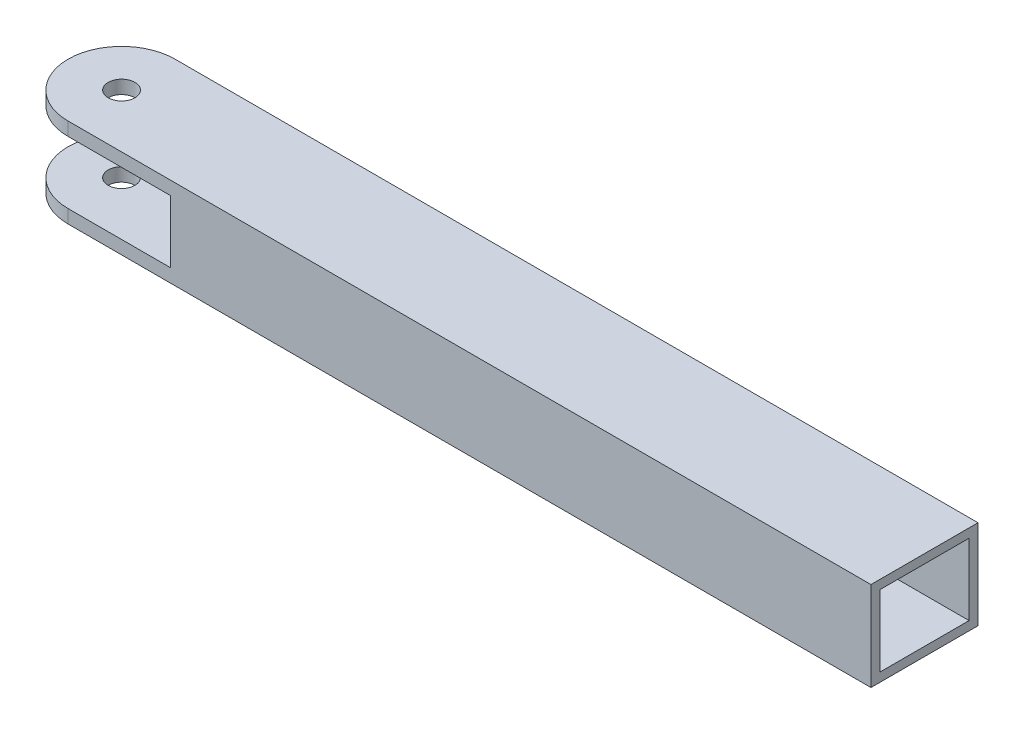
ISO-10303-21;
HEADER;
FILE_DESCRIPTION(('STEP AP214'),'2;1');
FILE_NAME('part.step','',(''),(''),'','','');
FILE_SCHEMA(('AUTOMOTIVE_DESIGN { 1 0 10303 214 1 1 1 1 }'));
ENDSEC;
DATA;
#1=APPLICATION_CONTEXT('core data for automotive mechanical design processes');
#2=APPLICATION_PROTOCOL_DEFINITION('international standard','automotive_design',2000,#1);
#3=PRODUCT_CONTEXT('',#1,'mechanical');
#4=PRODUCT('Part','Part','',(#3));
#5=PRODUCT_RELATED_PRODUCT_CATEGORY('part','',(#4));
#6=PRODUCT_DEFINITION_FORMATION('','',#4);
#7=PRODUCT_DEFINITION_CONTEXT('part definition',#1,'design');
#8=PRODUCT_DEFINITION('design','',#6,#7);
#9=PRODUCT_DEFINITION_SHAPE('','',#8);
#10=(LENGTH_UNIT() NAMED_UNIT(*) SI_UNIT(.MILLI.,.METRE.));
#11=(NAMED_UNIT(*) PLANE_ANGLE_UNIT() SI_UNIT($,.RADIAN.));
#12=(NAMED_UNIT(*) SI_UNIT($,.STERADIAN.) SOLID_ANGLE_UNIT());
#13=UNCERTAINTY_MEASURE_WITH_UNIT(LENGTH_MEASURE(1.E-05),#10,'distance_accuracy_value','');
#14=(GEOMETRIC_REPRESENTATION_CONTEXT(3) GLOBAL_UNCERTAINTY_ASSIGNED_CONTEXT((#13)) GLOBAL_UNIT_ASSIGNED_CONTEXT((#10,
#11,#12)) REPRESENTATION_CONTEXT('',''));
#15=CARTESIAN_POINT('',(0.,0.,0.));
#16=DIRECTION('',(0.,0.,1.));
#17=DIRECTION('',(1.,0.,0.));
#18=AXIS2_PLACEMENT_3D('',#15,#16,#17);
#19=CARTESIAN_POINT('',(0.,10.,0.));
#20=DIRECTION('',(0.,-1.,0.));
#21=DIRECTION('',(0.,0.,-1.));
#22=AXIS2_PLACEMENT_3D('',#19,#20,#21);
#23=CYLINDRICAL_SURFACE('',#22,6.);
#24=DIRECTION('',(0.,-1.,0.));
#25=VECTOR('',#24,1.);
#26=CARTESIAN_POINT('',(0.,10.,6.));
#27=LINE('',#26,#25);
#28=CARTESIAN_POINT('',(0.,1.5,6.));
#29=VERTEX_POINT('',#28);
#30=CARTESIAN_POINT('',(0.,0.,6.));
#31=VERTEX_POINT('',#30);
#32=EDGE_CURVE('E58',#29,#31,#27,.T.);
#33=ORIENTED_EDGE('',*,*,#32,.F.);
#34=CARTESIAN_POINT('',(0.,1.5,0.));
#35=DIRECTION('',(0.,-1.,0.));
#36=DIRECTION('',(0.,0.,-1.));
#37=AXIS2_PLACEMENT_3D('',#34,#35,#36);
#38=CIRCLE('',#37,6.);
#39=CARTESIAN_POINT('',(0.,1.5,-6.));
#40=VERTEX_POINT('',#39);
#41=EDGE_CURVE('E224',#29,#40,#38,.T.);
#42=ORIENTED_EDGE('',*,*,#41,.T.);
#43=DIRECTION('',(0.,-1.,0.));
#44=VECTOR('',#43,1.);
#45=CARTESIAN_POINT('',(0.,10.,-6.));
#46=LINE('',#45,#44);
#47=CARTESIAN_POINT('',(0.,0.,-6.));
#48=VERTEX_POINT('',#47);
#49=EDGE_CURVE('E250',#40,#48,#46,.T.);
#50=ORIENTED_EDGE('',*,*,#49,.T.);
#51=CARTESIAN_POINT('',(0.,0.,0.));
#52=DIRECTION('',(0.,1.,0.));
#53=DIRECTION('',(0.,0.,1.));
#54=AXIS2_PLACEMENT_3D('',#51,#52,#53);
#55=CIRCLE('',#54,6.);
#56=EDGE_CURVE('E233',#48,#31,#55,.T.);
#57=ORIENTED_EDGE('',*,*,#56,.T.);
#58=EDGE_LOOP('',(#33,#42,#50,#57));
#59=FACE_BOUND('',#58,.T.);
#60=ADVANCED_FACE('F48',(#59),#23,.T.);
#61=CARTESIAN_POINT('',(0.,10.,0.));
#62=DIRECTION('',(0.,-1.,0.));
#63=DIRECTION('',(0.,0.,-1.));
#64=AXIS2_PLACEMENT_3D('',#61,#62,#63);
#65=CYLINDRICAL_SURFACE('',#64,1.5);
#66=CARTESIAN_POINT('',(0.,1.5,0.));
#67=DIRECTION('',(0.,-1.,0.));
#68=DIRECTION('',(0.,0.,-1.));
#69=AXIS2_PLACEMENT_3D('',#66,#67,#68);
#70=CIRCLE('',#69,1.5);
#71=CARTESIAN_POINT('',(0.,1.5,-1.5));
#72=VERTEX_POINT('',#71);
#73=EDGE_CURVE('E52',#72,#72,#70,.T.);
#74=ORIENTED_EDGE('',*,*,#73,.F.);
#75=EDGE_LOOP('',(#74));
#76=FACE_BOUND('',#75,.T.);
#77=CARTESIAN_POINT('',(0.,0.,0.));
#78=DIRECTION('',(0.,1.,0.));
#79=DIRECTION('',(0.,0.,1.));
#80=AXIS2_PLACEMENT_3D('',#77,#78,#79);
#81=CIRCLE('',#80,1.5);
#82=CARTESIAN_POINT('',(0.,0.,1.5));
#83=VERTEX_POINT('',#82);
#84=EDGE_CURVE('E228',#83,#83,#81,.T.);
#85=ORIENTED_EDGE('',*,*,#84,.F.);
#86=EDGE_LOOP('',(#85));
#87=FACE_BOUND('',#86,.T.);
#88=ADVANCED_FACE('F288',(#76,#87),#65,.F.);
#89=CARTESIAN_POINT('',(0.,10.,0.));
#90=DIRECTION('',(0.,1.,0.));
#91=DIRECTION('',(0.,0.,1.));
#92=AXIS2_PLACEMENT_3D('',#89,#90,#91);
#93=PLANE('',#92);
#94=CARTESIAN_POINT('',(0.,10.,0.));
#95=DIRECTION('',(0.,1.,0.));
#96=DIRECTION('',(0.,0.,1.));
#97=AXIS2_PLACEMENT_3D('',#94,#95,#96);
#98=CIRCLE('',#97,6.);
#99=CARTESIAN_POINT('',(0.,10.,-6.));
#100=VERTEX_POINT('',#99);
#101=CARTESIAN_POINT('',(0.,10.,6.));
#102=VERTEX_POINT('',#101);
#103=EDGE_CURVE('E237',#100,#102,#98,.T.);
#104=ORIENTED_EDGE('',*,*,#103,.T.);
#105=DIRECTION('',(1.,0.,0.));
#106=VECTOR('',#105,1.);
#107=CARTESIAN_POINT('',(0.,10.,6.));
#108=LINE('',#107,#106);
#109=CARTESIAN_POINT('',(90.,10.,6.));
#110=VERTEX_POINT('',#109);
#111=EDGE_CURVE('E241',#102,#110,#108,.T.);
#112=ORIENTED_EDGE('',*,*,#111,.T.);
#113=DIRECTION('',(0.,0.,-1.));
#114=VECTOR('',#113,1.);
#115=CARTESIAN_POINT('',(90.,10.,-6.));
#116=LINE('',#115,#114);
#117=CARTESIAN_POINT('',(90.,10.,-6.));
#118=VERTEX_POINT('',#117);
#119=EDGE_CURVE('E244',#110,#118,#116,.T.);
#120=ORIENTED_EDGE('',*,*,#119,.T.);
#121=DIRECTION('',(-1.,0.,0.));
#122=VECTOR('',#121,1.);
#123=CARTESIAN_POINT('',(0.,10.,-6.));
#124=LINE('',#123,#122);
#125=EDGE_CURVE('E247',#118,#100,#124,.T.);
#126=ORIENTED_EDGE('',*,*,#125,.T.);
#127=EDGE_LOOP('',(#104,#112,#120,#126));
#128=FACE_BOUND('',#127,.T.);
#129=CARTESIAN_POINT('',(0.,10.,0.));
#130=DIRECTION('',(0.,1.,0.));
#131=DIRECTION('',(0.,0.,1.));
#132=AXIS2_PLACEMENT_3D('',#129,#130,#131);
#133=CIRCLE('',#132,1.5);
#134=CARTESIAN_POINT('',(0.,10.,1.5));
#135=VERTEX_POINT('',#134);
#136=EDGE_CURVE('E229',#135,#135,#133,.T.);
#137=ORIENTED_EDGE('',*,*,#136,.F.);
#138=EDGE_LOOP('',(#137));
#139=FACE_BOUND('',#138,.T.);
#140=ADVANCED_FACE('F291',(#128,#139),#93,.T.);
#141=CARTESIAN_POINT('',(0.,0.,0.));
#142=DIRECTION('',(0.,1.,0.));
#143=DIRECTION('',(0.,0.,1.));
#144=AXIS2_PLACEMENT_3D('',#141,#142,#143);
#145=PLANE('',#144);
#146=ORIENTED_EDGE('',*,*,#56,.F.);
#147=DIRECTION('',(-1.,0.,0.));
#148=VECTOR('',#147,1.);
#149=CARTESIAN_POINT('',(0.,0.,-6.));
#150=LINE('',#149,#148);
#151=CARTESIAN_POINT('',(90.,0.,-6.));
#152=VERTEX_POINT('',#151);
#153=EDGE_CURVE('E242',#152,#48,#150,.T.);
#154=ORIENTED_EDGE('',*,*,#153,.F.);
#155=DIRECTION('',(0.,0.,-1.));
#156=VECTOR('',#155,1.);
#157=CARTESIAN_POINT('',(90.,0.,-6.));
#158=LINE('',#157,#156);
#159=CARTESIAN_POINT('',(90.,0.,6.));
#160=VERTEX_POINT('',#159);
#161=EDGE_CURVE('E257',#160,#152,#158,.T.);
#162=ORIENTED_EDGE('',*,*,#161,.F.);
#163=DIRECTION('',(1.,0.,0.));
#164=VECTOR('',#163,1.);
#165=CARTESIAN_POINT('',(0.,0.,6.));
#166=LINE('',#165,#164);
#167=EDGE_CURVE('E254',#31,#160,#166,.T.);
#168=ORIENTED_EDGE('',*,*,#167,.F.);
#169=EDGE_LOOP('',(#146,#154,#162,#168));
#170=FACE_BOUND('',#169,.T.);
#171=ORIENTED_EDGE('',*,*,#84,.T.);
#172=EDGE_LOOP('',(#171));
#173=FACE_BOUND('',#172,.T.);
#174=ADVANCED_FACE('F293',(#170,#173),#145,.F.);
#175=CARTESIAN_POINT('',(0.,8.5,-6.));
#176=VERTEX_POINT('',#175);
#177=EDGE_CURVE('E263',#100,#176,#46,.T.);
#178=ORIENTED_EDGE('',*,*,#177,.T.);
#179=CARTESIAN_POINT('',(0.,8.5,0.));
#180=DIRECTION('',(0.,1.,0.));
#181=DIRECTION('',(0.,0.,1.));
#182=AXIS2_PLACEMENT_3D('',#179,#180,#181);
#183=CIRCLE('',#182,6.);
#184=CARTESIAN_POINT('',(0.,8.5,6.));
#185=VERTEX_POINT('',#184);
#186=EDGE_CURVE('E74',#176,#185,#183,.T.);
#187=ORIENTED_EDGE('',*,*,#186,.T.);
#188=EDGE_CURVE('E11',#102,#185,#27,.T.);
#189=ORIENTED_EDGE('',*,*,#188,.F.);
#190=ORIENTED_EDGE('',*,*,#103,.F.);
#191=EDGE_LOOP('',(#178,#187,#189,#190));
#192=FACE_BOUND('',#191,.T.);
#193=ADVANCED_FACE('F50',(#192),#23,.T.);
#194=CARTESIAN_POINT('',(0.,10.,6.));
#195=DIRECTION('',(0.,0.,-1.));
#196=DIRECTION('',(-1.,0.,0.));
#197=AXIS2_PLACEMENT_3D('',#194,#195,#196);
#198=PLANE('',#197);
#199=DIRECTION('',(0.,-1.,0.));
#200=VECTOR('',#199,1.);
#201=CARTESIAN_POINT('',(11.5,8.5,6.));
#202=LINE('',#201,#200);
#203=CARTESIAN_POINT('',(11.5,8.5,6.));
#204=VERTEX_POINT('',#203);
#205=CARTESIAN_POINT('',(11.5,1.5,6.));
#206=VERTEX_POINT('',#205);
#207=EDGE_CURVE('E198',#204,#206,#202,.T.);
#208=ORIENTED_EDGE('',*,*,#207,.T.);
#209=DIRECTION('',(-1.,0.,0.));
#210=VECTOR('',#209,1.);
#211=CARTESIAN_POINT('',(11.5,1.5,6.));
#212=LINE('',#211,#210);
#213=EDGE_CURVE('E203',#206,#29,#212,.T.);
#214=ORIENTED_EDGE('',*,*,#213,.T.);
#215=ORIENTED_EDGE('',*,*,#32,.T.);
#216=ORIENTED_EDGE('',*,*,#167,.T.);
#217=DIRECTION('',(0.,-1.,0.));
#218=VECTOR('',#217,1.);
#219=CARTESIAN_POINT('',(90.,10.,6.));
#220=LINE('',#219,#218);
#221=EDGE_CURVE('E271',#110,#160,#220,.T.);
#222=ORIENTED_EDGE('',*,*,#221,.F.);
#223=ORIENTED_EDGE('',*,*,#111,.F.);
#224=ORIENTED_EDGE('',*,*,#188,.T.);
#225=DIRECTION('',(1.,0.,0.));
#226=VECTOR('',#225,1.);
#227=CARTESIAN_POINT('',(11.5,8.5,6.));
#228=LINE('',#227,#226);
#229=EDGE_CURVE('E194',#185,#204,#228,.T.);
#230=ORIENTED_EDGE('',*,*,#229,.T.);
#231=EDGE_LOOP('',(#208,#214,#215,#216,#222,#223,#224,#230));
#232=FACE_BOUND('',#231,.T.);
#233=ADVANCED_FACE('F309',(#232),#198,.F.);
#234=CARTESIAN_POINT('',(90.,10.,-6.));
#235=DIRECTION('',(-1.,0.,0.));
#236=DIRECTION('',(0.,0.,1.));
#237=AXIS2_PLACEMENT_3D('',#234,#235,#236);
#238=PLANE('',#237);
#239=DIRECTION('',(0.,0.,1.));
#240=VECTOR('',#239,1.);
#241=CARTESIAN_POINT('',(90.,9.,-5.));
#242=LINE('',#241,#240);
#243=CARTESIAN_POINT('',(90.,9.,-5.));
#244=VERTEX_POINT('',#243);
#245=CARTESIAN_POINT('',(90.,9.,5.));
#246=VERTEX_POINT('',#245);
#247=EDGE_CURVE('E179',#244,#246,#242,.T.);
#248=ORIENTED_EDGE('',*,*,#247,.F.);
#249=DIRECTION('',(0.,1.,0.));
#250=VECTOR('',#249,1.);
#251=CARTESIAN_POINT('',(90.,1.,-5.));
#252=LINE('',#251,#250);
#253=CARTESIAN_POINT('',(90.,1.,-5.));
#254=VERTEX_POINT('',#253);
#255=EDGE_CURVE('E66',#254,#244,#252,.T.);
#256=ORIENTED_EDGE('',*,*,#255,.F.);
#257=DIRECTION('',(0.,0.,-1.));
#258=VECTOR('',#257,1.);
#259=CARTESIAN_POINT('',(90.,1.,5.));
#260=LINE('',#259,#258);
#261=CARTESIAN_POINT('',(90.,1.,5.));
#262=VERTEX_POINT('',#261);
#263=EDGE_CURVE('E163',#262,#254,#260,.T.);
#264=ORIENTED_EDGE('',*,*,#263,.F.);
#265=DIRECTION('',(0.,-1.,0.));
#266=VECTOR('',#265,1.);
#267=CARTESIAN_POINT('',(90.,9.,5.));
#268=LINE('',#267,#266);
#269=EDGE_CURVE('E170',#246,#262,#268,.T.);
#270=ORIENTED_EDGE('',*,*,#269,.F.);
#271=EDGE_LOOP('',(#248,#256,#264,#270));
#272=FACE_BOUND('',#271,.T.);
#273=ORIENTED_EDGE('',*,*,#161,.T.);
#274=DIRECTION('',(0.,-1.,0.));
#275=VECTOR('',#274,1.);
#276=CARTESIAN_POINT('',(90.,10.,-6.));
#277=LINE('',#276,#275);
#278=EDGE_CURVE('E267',#118,#152,#277,.T.);
#279=ORIENTED_EDGE('',*,*,#278,.F.);
#280=ORIENTED_EDGE('',*,*,#119,.F.);
#281=ORIENTED_EDGE('',*,*,#221,.T.);
#282=EDGE_LOOP('',(#273,#279,#280,#281));
#283=FACE_BOUND('',#282,.T.);
#284=ADVANCED_FACE('F314',(#272,#283),#238,.F.);
#285=CARTESIAN_POINT('',(0.,10.,-6.));
#286=DIRECTION('',(0.,0.,1.));
#287=DIRECTION('',(1.,0.,0.));
#288=AXIS2_PLACEMENT_3D('',#285,#286,#287);
#289=PLANE('',#288);
#290=ORIENTED_EDGE('',*,*,#49,.F.);
#291=DIRECTION('',(-1.,0.,0.));
#292=VECTOR('',#291,1.);
#293=CARTESIAN_POINT('',(11.5,1.5,-6.));
#294=LINE('',#293,#292);
#295=CARTESIAN_POINT('',(11.5,1.5,-6.));
#296=VERTEX_POINT('',#295);
#297=EDGE_CURVE('E199',#296,#40,#294,.T.);
#298=ORIENTED_EDGE('',*,*,#297,.F.);
#299=DIRECTION('',(0.,-1.,0.));
#300=VECTOR('',#299,1.);
#301=CARTESIAN_POINT('',(11.5,8.5,-6.));
#302=LINE('',#301,#300);
#303=CARTESIAN_POINT('',(11.5,8.5,-6.));
#304=VERTEX_POINT('',#303);
#305=EDGE_CURVE('E210',#304,#296,#302,.T.);
#306=ORIENTED_EDGE('',*,*,#305,.F.);
#307=DIRECTION('',(1.,0.,0.));
#308=VECTOR('',#307,1.);
#309=CARTESIAN_POINT('',(11.5,8.5,-6.));
#310=LINE('',#309,#308);
#311=EDGE_CURVE('E188',#176,#304,#310,.T.);
#312=ORIENTED_EDGE('',*,*,#311,.F.);
#313=ORIENTED_EDGE('',*,*,#177,.F.);
#314=ORIENTED_EDGE('',*,*,#125,.F.);
#315=ORIENTED_EDGE('',*,*,#278,.T.);
#316=ORIENTED_EDGE('',*,*,#153,.T.);
#317=EDGE_LOOP('',(#290,#298,#306,#312,#313,#314,#315,#316));
#318=FACE_BOUND('',#317,.T.);
#319=ADVANCED_FACE('F286',(#318),#289,.F.);
#320=CARTESIAN_POINT('',(0.,8.5,0.));
#321=DIRECTION('',(0.,1.,0.));
#322=DIRECTION('',(0.,0.,1.));
#323=AXIS2_PLACEMENT_3D('',#320,#321,#322);
#324=CIRCLE('',#323,1.5);
#325=CARTESIAN_POINT('',(0.,8.5,1.5));
#326=VERTEX_POINT('',#325);
#327=EDGE_CURVE('E218',#326,#326,#324,.T.);
#328=ORIENTED_EDGE('',*,*,#327,.F.);
#329=EDGE_LOOP('',(#328));
#330=FACE_BOUND('',#329,.T.);
#331=ORIENTED_EDGE('',*,*,#136,.T.);
#332=EDGE_LOOP('',(#331));
#333=FACE_BOUND('',#332,.T.);
#334=ADVANCED_FACE('F282',(#330,#333),#65,.F.);
#335=CARTESIAN_POINT('',(11.5,1.5,6.));
#336=DIRECTION('',(0.,-1.,0.));
#337=DIRECTION('',(0.,0.,-1.));
#338=AXIS2_PLACEMENT_3D('',#335,#336,#337);
#339=PLANE('',#338);
#340=ORIENTED_EDGE('',*,*,#73,.T.);
#341=EDGE_LOOP('',(#340));
#342=FACE_BOUND('',#341,.T.);
#343=ORIENTED_EDGE('',*,*,#213,.F.);
#344=DIRECTION('',(0.,0.,-1.));
#345=VECTOR('',#344,1.);
#346=CARTESIAN_POINT('',(11.5,1.5,6.));
#347=LINE('',#346,#345);
#348=EDGE_CURVE('E215',#206,#296,#347,.T.);
#349=ORIENTED_EDGE('',*,*,#348,.T.);
#350=ORIENTED_EDGE('',*,*,#297,.T.);
#351=ORIENTED_EDGE('',*,*,#41,.F.);
#352=EDGE_LOOP('',(#343,#349,#350,#351));
#353=FACE_BOUND('',#352,.T.);
#354=ADVANCED_FACE('F285',(#342,#353),#339,.F.);
#355=CARTESIAN_POINT('',(11.5,8.5,6.));
#356=DIRECTION('',(0.,1.,0.));
#357=DIRECTION('',(0.,0.,1.));
#358=AXIS2_PLACEMENT_3D('',#355,#356,#357);
#359=PLANE('',#358);
#360=ORIENTED_EDGE('',*,*,#327,.T.);
#361=EDGE_LOOP('',(#360));
#362=FACE_BOUND('',#361,.T.);
#363=ORIENTED_EDGE('',*,*,#311,.T.);
#364=DIRECTION('',(0.,0.,-1.));
#365=VECTOR('',#364,1.);
#366=CARTESIAN_POINT('',(11.5,8.5,6.));
#367=LINE('',#366,#365);
#368=EDGE_CURVE('E207',#204,#304,#367,.T.);
#369=ORIENTED_EDGE('',*,*,#368,.F.);
#370=ORIENTED_EDGE('',*,*,#229,.F.);
#371=ORIENTED_EDGE('',*,*,#186,.F.);
#372=EDGE_LOOP('',(#363,#369,#370,#371));
#373=FACE_BOUND('',#372,.T.);
#374=ADVANCED_FACE('F280',(#362,#373),#359,.F.);
#375=CARTESIAN_POINT('',(11.5,8.5,6.));
#376=DIRECTION('',(1.,0.,0.));
#377=DIRECTION('',(0.,0.,-1.));
#378=AXIS2_PLACEMENT_3D('',#375,#376,#377);
#379=PLANE('',#378);
#380=ORIENTED_EDGE('',*,*,#305,.T.);
#381=ORIENTED_EDGE('',*,*,#348,.F.);
#382=ORIENTED_EDGE('',*,*,#207,.F.);
#383=ORIENTED_EDGE('',*,*,#368,.T.);
#384=EDGE_LOOP('',(#380,#381,#382,#383));
#385=FACE_BOUND('',#384,.T.);
#386=ADVANCED_FACE('F326',(#385),#379,.F.);
#387=CARTESIAN_POINT('',(15.,1.,-5.));
#388=DIRECTION('',(0.,0.,-1.));
#389=DIRECTION('',(-1.,0.,0.));
#390=AXIS2_PLACEMENT_3D('',#387,#388,#389);
#391=PLANE('',#390);
#392=ORIENTED_EDGE('',*,*,#255,.T.);
#393=DIRECTION('',(1.,0.,0.));
#394=VECTOR('',#393,1.);
#395=CARTESIAN_POINT('',(15.,9.,-5.));
#396=LINE('',#395,#394);
#397=CARTESIAN_POINT('',(15.,9.,-5.));
#398=VERTEX_POINT('',#397);
#399=EDGE_CURVE('E138',#398,#244,#396,.T.);
#400=ORIENTED_EDGE('',*,*,#399,.F.);
#401=DIRECTION('',(0.,1.,0.));
#402=VECTOR('',#401,1.);
#403=CARTESIAN_POINT('',(15.,1.,-5.));
#404=LINE('',#403,#402);
#405=CARTESIAN_POINT('',(15.,1.,-5.));
#406=VERTEX_POINT('',#405);
#407=EDGE_CURVE('E142',#406,#398,#404,.T.);
#408=ORIENTED_EDGE('',*,*,#407,.F.);
#409=DIRECTION('',(1.,0.,0.));
#410=VECTOR('',#409,1.);
#411=CARTESIAN_POINT('',(15.,1.,-5.));
#412=LINE('',#411,#410);
#413=EDGE_CURVE('E185',#406,#254,#412,.T.);
#414=ORIENTED_EDGE('',*,*,#413,.T.);
#415=EDGE_LOOP('',(#392,#400,#408,#414));
#416=FACE_BOUND('',#415,.T.);
#417=ADVANCED_FACE('F140',(#416),#391,.F.);
#418=CARTESIAN_POINT('',(15.,1.,5.));
#419=DIRECTION('',(0.,-1.,0.));
#420=DIRECTION('',(0.,0.,-1.));
#421=AXIS2_PLACEMENT_3D('',#418,#419,#420);
#422=PLANE('',#421);
#423=ORIENTED_EDGE('',*,*,#263,.T.);
#424=ORIENTED_EDGE('',*,*,#413,.F.);
#425=DIRECTION('',(0.,0.,-1.));
#426=VECTOR('',#425,1.);
#427=CARTESIAN_POINT('',(15.,1.,5.));
#428=LINE('',#427,#426);
#429=CARTESIAN_POINT('',(15.,1.,5.));
#430=VERTEX_POINT('',#429);
#431=EDGE_CURVE('E149',#430,#406,#428,.T.);
#432=ORIENTED_EDGE('',*,*,#431,.F.);
#433=DIRECTION('',(1.,0.,0.));
#434=VECTOR('',#433,1.);
#435=CARTESIAN_POINT('',(15.,1.,5.));
#436=LINE('',#435,#434);
#437=EDGE_CURVE('E189',#430,#262,#436,.T.);
#438=ORIENTED_EDGE('',*,*,#437,.T.);
#439=EDGE_LOOP('',(#423,#424,#432,#438));
#440=FACE_BOUND('',#439,.T.);
#441=ADVANCED_FACE('F396',(#440),#422,.F.);
#442=CARTESIAN_POINT('',(15.,9.,5.));
#443=DIRECTION('',(0.,0.,1.));
#444=DIRECTION('',(1.,0.,0.));
#445=AXIS2_PLACEMENT_3D('',#442,#443,#444);
#446=PLANE('',#445);
#447=ORIENTED_EDGE('',*,*,#269,.T.);
#448=ORIENTED_EDGE('',*,*,#437,.F.);
#449=DIRECTION('',(0.,-1.,0.));
#450=VECTOR('',#449,1.);
#451=CARTESIAN_POINT('',(15.,9.,5.));
#452=LINE('',#451,#450);
#453=CARTESIAN_POINT('',(15.,9.,5.));
#454=VERTEX_POINT('',#453);
#455=EDGE_CURVE('E158',#454,#430,#452,.T.);
#456=ORIENTED_EDGE('',*,*,#455,.F.);
#457=DIRECTION('',(1.,0.,0.));
#458=VECTOR('',#457,1.);
#459=CARTESIAN_POINT('',(15.,9.,5.));
#460=LINE('',#459,#458);
#461=EDGE_CURVE('E148',#454,#246,#460,.T.);
#462=ORIENTED_EDGE('',*,*,#461,.T.);
#463=EDGE_LOOP('',(#447,#448,#456,#462));
#464=FACE_BOUND('',#463,.T.);
#465=ADVANCED_FACE('F400',(#464),#446,.F.);
#466=CARTESIAN_POINT('',(15.,9.,-5.));
#467=DIRECTION('',(0.,1.,0.));
#468=DIRECTION('',(0.,0.,1.));
#469=AXIS2_PLACEMENT_3D('',#466,#467,#468);
#470=PLANE('',#469);
#471=ORIENTED_EDGE('',*,*,#247,.T.);
#472=ORIENTED_EDGE('',*,*,#461,.F.);
#473=DIRECTION('',(0.,0.,1.));
#474=VECTOR('',#473,1.);
#475=CARTESIAN_POINT('',(15.,9.,-5.));
#476=LINE('',#475,#474);
#477=EDGE_CURVE('E152',#398,#454,#476,.T.);
#478=ORIENTED_EDGE('',*,*,#477,.F.);
#479=ORIENTED_EDGE('',*,*,#399,.T.);
#480=EDGE_LOOP('',(#471,#472,#478,#479));
#481=FACE_BOUND('',#480,.T.);
#482=ADVANCED_FACE('F153',(#481),#470,.F.);
#483=CARTESIAN_POINT('',(15.,0.,0.));
#484=DIRECTION('',(1.,0.,0.));
#485=DIRECTION('',(0.,0.,-1.));
#486=AXIS2_PLACEMENT_3D('',#483,#484,#485);
#487=PLANE('',#486);
#488=ORIENTED_EDGE('',*,*,#407,.T.);
#489=ORIENTED_EDGE('',*,*,#477,.T.);
#490=ORIENTED_EDGE('',*,*,#455,.T.);
#491=ORIENTED_EDGE('',*,*,#431,.T.);
#492=EDGE_LOOP('',(#488,#489,#490,#491));
#493=FACE_BOUND('',#492,.T.);
#494=ADVANCED_FACE('F160',(#493),#487,.T.);
#495=CLOSED_SHELL('',(#60,#88,#140,#174,#193,#233,#284,#319,#334,#354,#374,#386,#417,#441,#465,
#482,#494));
#496=MANIFOLD_SOLID_BREP('B2',#495);
#497=ADVANCED_BREP_SHAPE_REPRESENTATION('',(#18,#496),#14);
#498=SHAPE_DEFINITION_REPRESENTATION(#9,#497);
ENDSEC;
END-ISO-10303-21;
